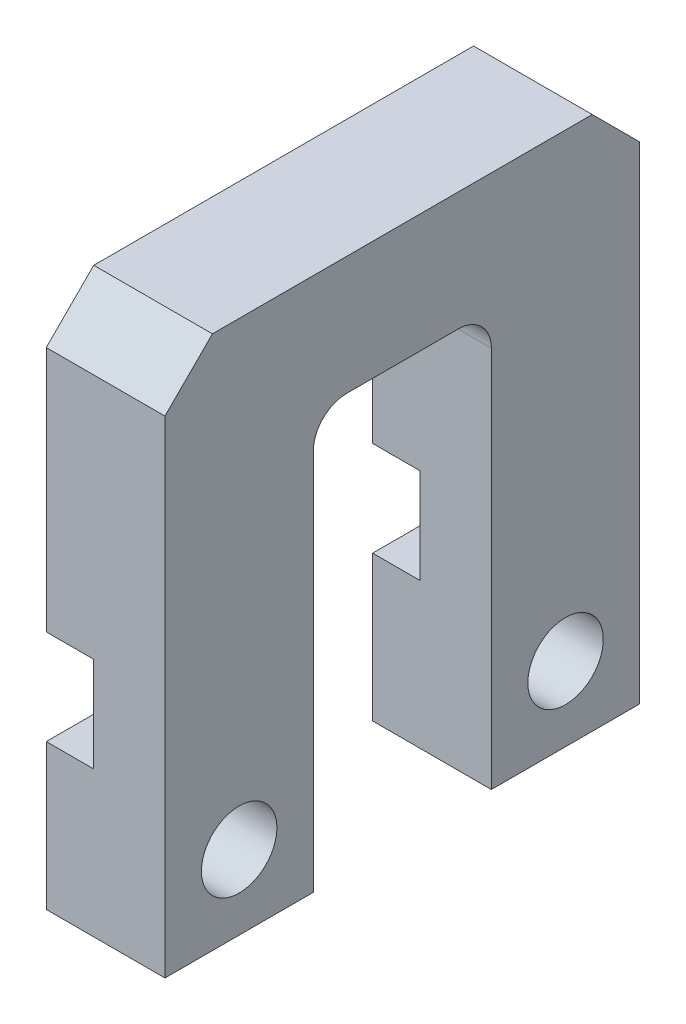
ISO-10303-21;
HEADER;
FILE_DESCRIPTION(('STEP AP214'),'2;1');
FILE_NAME('part.step','',(''),(''),'','','');
FILE_SCHEMA(('AUTOMOTIVE_DESIGN { 1 0 10303 214 1 1 1 1 }'));
ENDSEC;
DATA;
#1=APPLICATION_CONTEXT('core data for automotive mechanical design processes');
#2=APPLICATION_PROTOCOL_DEFINITION('international standard','automotive_design',2000,#1);
#3=PRODUCT_CONTEXT('',#1,'mechanical');
#4=PRODUCT('Part','Part','',(#3));
#5=PRODUCT_RELATED_PRODUCT_CATEGORY('part','',(#4));
#6=PRODUCT_DEFINITION_FORMATION('','',#4);
#7=PRODUCT_DEFINITION_CONTEXT('part definition',#1,'design');
#8=PRODUCT_DEFINITION('design','',#6,#7);
#9=PRODUCT_DEFINITION_SHAPE('','',#8);
#10=(LENGTH_UNIT() NAMED_UNIT(*) SI_UNIT(.MILLI.,.METRE.));
#11=(NAMED_UNIT(*) PLANE_ANGLE_UNIT() SI_UNIT($,.RADIAN.));
#12=(NAMED_UNIT(*) SI_UNIT($,.STERADIAN.) SOLID_ANGLE_UNIT());
#13=UNCERTAINTY_MEASURE_WITH_UNIT(LENGTH_MEASURE(1.E-05),#10,'distance_accuracy_value','');
#14=(GEOMETRIC_REPRESENTATION_CONTEXT(3) GLOBAL_UNCERTAINTY_ASSIGNED_CONTEXT((#13)) GLOBAL_UNIT_ASSIGNED_CONTEXT((#10,
#11,#12)) REPRESENTATION_CONTEXT('',''));
#15=CARTESIAN_POINT('',(0.,0.,0.));
#16=DIRECTION('',(0.,0.,1.));
#17=DIRECTION('',(1.,0.,0.));
#18=AXIS2_PLACEMENT_3D('',#15,#16,#17);
#19=CARTESIAN_POINT('',(0.,20.447,-15.6845));
#20=DIRECTION('',(-1.,0.,0.));
#21=DIRECTION('',(0.,0.,1.));
#22=AXIS2_PLACEMENT_3D('',#19,#20,#21);
#23=PLANE('',#22);
#24=DIRECTION('',(0.,0.,1.));
#25=VECTOR('',#24,1.);
#26=CARTESIAN_POINT('',(0.,28.575,0.));
#27=LINE('',#26,#25);
#28=CARTESIAN_POINT('',(0.,28.575,-22.86));
#29=VERTEX_POINT('',#28);
#30=CARTESIAN_POINT('',(0.,28.575,-2.54000000000001));
#31=VERTEX_POINT('',#30);
#32=EDGE_CURVE('E309',#29,#31,#27,.T.);
#33=ORIENTED_EDGE('',*,*,#32,.F.);
#34=DIRECTION('',(0.,0.707106781186549,0.707106781186546));
#35=VECTOR('',#34,1.);
#36=CARTESIAN_POINT('',(0.,28.09875,-23.33625));
#37=LINE('',#36,#35);
#38=CARTESIAN_POINT('',(0.,26.035,-25.4));
#39=VERTEX_POINT('',#38);
#40=EDGE_CURVE('E412',#29,#39,#37,.F.);
#41=ORIENTED_EDGE('',*,*,#40,.T.);
#42=DIRECTION('',(0.,1.,0.));
#43=VECTOR('',#42,1.);
#44=CARTESIAN_POINT('',(0.,0.,-25.4));
#45=LINE('',#44,#43);
#46=CARTESIAN_POINT('',(0.,12.85875,-25.4));
#47=VERTEX_POINT('',#46);
#48=EDGE_CURVE('E363',#47,#39,#45,.T.);
#49=ORIENTED_EDGE('',*,*,#48,.F.);
#50=DIRECTION('',(0.,0.,-1.));
#51=VECTOR('',#50,1.);
#52=CARTESIAN_POINT('',(0.,12.85875,-15.6845));
#53=LINE('',#52,#51);
#54=CARTESIAN_POINT('',(0.,12.85875,-17.4625));
#55=VERTEX_POINT('',#54);
#56=EDGE_CURVE('E399',#55,#47,#53,.T.);
#57=ORIENTED_EDGE('',*,*,#56,.F.);
#58=DIRECTION('',(0.,-1.,0.));
#59=VECTOR('',#58,1.);
#60=CARTESIAN_POINT('',(0.,20.447,-17.4625));
#61=LINE('',#60,#59);
#62=CARTESIAN_POINT('',(0.,20.447,-17.4625));
#63=VERTEX_POINT('',#62);
#64=EDGE_CURVE('E357',#63,#55,#61,.T.);
#65=ORIENTED_EDGE('',*,*,#64,.F.);
#66=CARTESIAN_POINT('',(0.,20.447,-15.6845));
#67=DIRECTION('',(-1.,0.,0.));
#68=DIRECTION('',(0.,0.,1.));
#69=AXIS2_PLACEMENT_3D('',#66,#67,#68);
#70=CIRCLE('',#69,1.778);
#71=CARTESIAN_POINT('',(0.,22.225,-15.6845));
#72=VERTEX_POINT('',#71);
#73=EDGE_CURVE('E353',#72,#63,#70,.T.);
#74=ORIENTED_EDGE('',*,*,#73,.F.);
#75=DIRECTION('',(0.,0.,-1.));
#76=VECTOR('',#75,1.);
#77=CARTESIAN_POINT('',(0.,22.225,-9.7155));
#78=LINE('',#77,#76);
#79=CARTESIAN_POINT('',(0.,22.225,-9.7155));
#80=VERTEX_POINT('',#79);
#81=EDGE_CURVE('E350',#80,#72,#78,.T.);
#82=ORIENTED_EDGE('',*,*,#81,.F.);
#83=CARTESIAN_POINT('',(0.,20.447,-9.7155));
#84=DIRECTION('',(-1.,0.,0.));
#85=DIRECTION('',(0.,0.,1.));
#86=AXIS2_PLACEMENT_3D('',#83,#84,#85);
#87=CIRCLE('',#86,1.778);
#88=CARTESIAN_POINT('',(0.,20.447,-7.9375));
#89=VERTEX_POINT('',#88);
#90=EDGE_CURVE('E347',#89,#80,#87,.T.);
#91=ORIENTED_EDGE('',*,*,#90,.F.);
#92=DIRECTION('',(0.,1.,0.));
#93=VECTOR('',#92,1.);
#94=CARTESIAN_POINT('',(0.,0.,-7.9375));
#95=LINE('',#94,#93);
#96=CARTESIAN_POINT('',(0.,12.85875,-7.9375));
#97=VERTEX_POINT('',#96);
#98=EDGE_CURVE('E342',#97,#89,#95,.T.);
#99=ORIENTED_EDGE('',*,*,#98,.F.);
#100=DIRECTION('',(0.,0.,-1.));
#101=VECTOR('',#100,1.);
#102=CARTESIAN_POINT('',(0.,12.85875,-25.4));
#103=LINE('',#102,#101);
#104=CARTESIAN_POINT('',(0.,12.85875,0.));
#105=VERTEX_POINT('',#104);
#106=EDGE_CURVE('E249',#105,#97,#103,.T.);
#107=ORIENTED_EDGE('',*,*,#106,.F.);
#108=DIRECTION('',(0.,-1.,0.));
#109=VECTOR('',#108,1.);
#110=CARTESIAN_POINT('',(0.,0.,0.));
#111=LINE('',#110,#109);
#112=CARTESIAN_POINT('',(0.,26.035,0.));
#113=VERTEX_POINT('',#112);
#114=EDGE_CURVE('E336',#113,#105,#111,.T.);
#115=ORIENTED_EDGE('',*,*,#114,.F.);
#116=DIRECTION('',(0.,-0.707106781186546,0.707106781186549));
#117=VECTOR('',#116,1.);
#118=CARTESIAN_POINT('',(0.,31.08325,-5.04825000000003));
#119=LINE('',#118,#117);
#120=EDGE_CURVE('E409',#113,#31,#119,.F.);
#121=ORIENTED_EDGE('',*,*,#120,.T.);
#122=EDGE_LOOP('',(#33,#41,#49,#57,#65,#74,#82,#91,#99,#107,#115,#121));
#123=FACE_BOUND('',#122,.T.);
#124=ADVANCED_FACE('F57',(#123),#23,.T.);
#125=DIRECTION('',(0.,0.,1.));
#126=VECTOR('',#125,1.);
#127=CARTESIAN_POINT('',(0.,7.77875,-25.4));
#128=LINE('',#127,#126);
#129=CARTESIAN_POINT('',(0.,7.77875,-25.4));
#130=VERTEX_POINT('',#129);
#131=CARTESIAN_POINT('',(0.,7.77875,-17.4625));
#132=VERTEX_POINT('',#131);
#133=EDGE_CURVE('E439',#130,#132,#128,.T.);
#134=ORIENTED_EDGE('',*,*,#133,.F.);
#135=CARTESIAN_POINT('',(0.,0.,-25.4));
#136=VERTEX_POINT('',#135);
#137=EDGE_CURVE('E255',#136,#130,#45,.T.);
#138=ORIENTED_EDGE('',*,*,#137,.F.);
#139=DIRECTION('',(0.,0.,-1.));
#140=VECTOR('',#139,1.);
#141=CARTESIAN_POINT('',(0.,0.,-17.4625));
#142=LINE('',#141,#140);
#143=CARTESIAN_POINT('',(0.,0.,-17.4625));
#144=VERTEX_POINT('',#143);
#145=EDGE_CURVE('E361',#144,#136,#142,.T.);
#146=ORIENTED_EDGE('',*,*,#145,.F.);
#147=EDGE_CURVE('E356',#132,#144,#61,.T.);
#148=ORIENTED_EDGE('',*,*,#147,.F.);
#149=EDGE_LOOP('',(#134,#138,#146,#148));
#150=FACE_BOUND('',#149,.T.);
#151=CARTESIAN_POINT('',(0.,3.96875,-21.43125));
#152=DIRECTION('',(-1.,0.,0.));
#153=DIRECTION('',(0.,0.,1.));
#154=AXIS2_PLACEMENT_3D('',#151,#152,#153);
#155=CIRCLE('',#154,2.0193);
#156=CARTESIAN_POINT('',(0.,3.96875,-19.41195));
#157=VERTEX_POINT('',#156);
#158=EDGE_CURVE('E290',#157,#157,#155,.T.);
#159=ORIENTED_EDGE('',*,*,#158,.F.);
#160=EDGE_LOOP('',(#159));
#161=FACE_BOUND('',#160,.T.);
#162=ADVANCED_FACE('F486',(#150,#161),#23,.T.);
#163=CARTESIAN_POINT('',(6.35,0.,0.));
#164=DIRECTION('',(0.,0.,-1.));
#165=DIRECTION('',(-1.,0.,0.));
#166=AXIS2_PLACEMENT_3D('',#163,#164,#165);
#167=PLANE('',#166);
#168=DIRECTION('',(0.,-1.,0.));
#169=VECTOR('',#168,1.);
#170=CARTESIAN_POINT('',(6.35,0.,0.));
#171=LINE('',#170,#169);
#172=CARTESIAN_POINT('',(6.35,26.035,0.));
#173=VERTEX_POINT('',#172);
#174=CARTESIAN_POINT('',(6.35,0.,0.));
#175=VERTEX_POINT('',#174);
#176=EDGE_CURVE('E305',#173,#175,#171,.T.);
#177=ORIENTED_EDGE('',*,*,#176,.F.);
#178=DIRECTION('',(-1.,0.,0.));
#179=VECTOR('',#178,1.);
#180=CARTESIAN_POINT('',(6.35,26.035,0.));
#181=LINE('',#180,#179);
#182=EDGE_CURVE('E11',#173,#113,#181,.T.);
#183=ORIENTED_EDGE('',*,*,#182,.T.);
#184=ORIENTED_EDGE('',*,*,#114,.T.);
#185=DIRECTION('',(-1.,0.,0.));
#186=VECTOR('',#185,1.);
#187=CARTESIAN_POINT('',(2.54,12.85875,0.));
#188=LINE('',#187,#186);
#189=CARTESIAN_POINT('',(2.54,12.85875,0.));
#190=VERTEX_POINT('',#189);
#191=EDGE_CURVE('E261',#190,#105,#188,.T.);
#192=ORIENTED_EDGE('',*,*,#191,.F.);
#193=DIRECTION('',(0.,1.,0.));
#194=VECTOR('',#193,1.);
#195=CARTESIAN_POINT('',(2.54,7.77875,0.));
#196=LINE('',#195,#194);
#197=CARTESIAN_POINT('',(2.54,7.77875,0.));
#198=VERTEX_POINT('',#197);
#199=EDGE_CURVE('E239',#198,#190,#196,.T.);
#200=ORIENTED_EDGE('',*,*,#199,.F.);
#201=DIRECTION('',(-1.,0.,0.));
#202=VECTOR('',#201,1.);
#203=CARTESIAN_POINT('',(2.54,7.77875,0.));
#204=LINE('',#203,#202);
#205=CARTESIAN_POINT('',(0.,7.77875,0.));
#206=VERTEX_POINT('',#205);
#207=EDGE_CURVE('E256',#198,#206,#204,.T.);
#208=ORIENTED_EDGE('',*,*,#207,.T.);
#209=CARTESIAN_POINT('',(0.,0.,0.));
#210=VERTEX_POINT('',#209);
#211=EDGE_CURVE('E304',#206,#210,#111,.T.);
#212=ORIENTED_EDGE('',*,*,#211,.T.);
#213=DIRECTION('',(-1.,0.,0.));
#214=VECTOR('',#213,1.);
#215=CARTESIAN_POINT('',(6.35,0.,0.));
#216=LINE('',#215,#214);
#217=EDGE_CURVE('E392',#175,#210,#216,.T.);
#218=ORIENTED_EDGE('',*,*,#217,.F.);
#219=EDGE_LOOP('',(#177,#183,#184,#192,#200,#208,#212,#218));
#220=FACE_BOUND('',#219,.T.);
#221=ADVANCED_FACE('F454',(#220),#167,.F.);
#222=CARTESIAN_POINT('',(6.35,0.,0.));
#223=DIRECTION('',(0.,1.,0.));
#224=DIRECTION('',(0.,0.,1.));
#225=AXIS2_PLACEMENT_3D('',#222,#223,#224);
#226=PLANE('',#225);
#227=DIRECTION('',(0.,0.,-1.));
#228=VECTOR('',#227,1.);
#229=CARTESIAN_POINT('',(0.,0.,0.));
#230=LINE('',#229,#228);
#231=CARTESIAN_POINT('',(0.,0.,-7.9375));
#232=VERTEX_POINT('',#231);
#233=EDGE_CURVE('E339',#210,#232,#230,.T.);
#234=ORIENTED_EDGE('',*,*,#233,.T.);
#235=DIRECTION('',(-1.,0.,0.));
#236=VECTOR('',#235,1.);
#237=CARTESIAN_POINT('',(6.35,0.,-7.9375));
#238=LINE('',#237,#236);
#239=CARTESIAN_POINT('',(6.35,0.,-7.9375));
#240=VERTEX_POINT('',#239);
#241=EDGE_CURVE('E388',#240,#232,#238,.T.);
#242=ORIENTED_EDGE('',*,*,#241,.F.);
#243=DIRECTION('',(0.,0.,-1.));
#244=VECTOR('',#243,1.);
#245=CARTESIAN_POINT('',(6.35,0.,0.));
#246=LINE('',#245,#244);
#247=EDGE_CURVE('E308',#175,#240,#246,.T.);
#248=ORIENTED_EDGE('',*,*,#247,.F.);
#249=ORIENTED_EDGE('',*,*,#217,.T.);
#250=EDGE_LOOP('',(#234,#242,#248,#249));
#251=FACE_BOUND('',#250,.T.);
#252=ADVANCED_FACE('F478',(#251),#226,.F.);
#253=CARTESIAN_POINT('',(6.35,0.,-7.9375));
#254=DIRECTION('',(0.,0.,1.));
#255=DIRECTION('',(1.,0.,0.));
#256=AXIS2_PLACEMENT_3D('',#253,#254,#255);
#257=PLANE('',#256);
#258=DIRECTION('',(0.,1.,0.));
#259=VECTOR('',#258,1.);
#260=CARTESIAN_POINT('',(2.54,0.,-7.9375));
#261=LINE('',#260,#259);
#262=CARTESIAN_POINT('',(2.54,7.77875,-7.9375));
#263=VERTEX_POINT('',#262);
#264=CARTESIAN_POINT('',(2.54,12.85875,-7.9375));
#265=VERTEX_POINT('',#264);
#266=EDGE_CURVE('E286',#263,#265,#261,.T.);
#267=ORIENTED_EDGE('',*,*,#266,.T.);
#268=DIRECTION('',(-1.,0.,0.));
#269=VECTOR('',#268,1.);
#270=CARTESIAN_POINT('',(6.35,12.85875,-7.9375));
#271=LINE('',#270,#269);
#272=EDGE_CURVE('E279',#265,#97,#271,.T.);
#273=ORIENTED_EDGE('',*,*,#272,.T.);
#274=ORIENTED_EDGE('',*,*,#98,.T.);
#275=DIRECTION('',(-1.,0.,0.));
#276=VECTOR('',#275,1.);
#277=CARTESIAN_POINT('',(6.35,20.447,-7.9375));
#278=LINE('',#277,#276);
#279=CARTESIAN_POINT('',(6.35,20.447,-7.9375));
#280=VERTEX_POINT('',#279);
#281=EDGE_CURVE('E384',#280,#89,#278,.T.);
#282=ORIENTED_EDGE('',*,*,#281,.F.);
#283=DIRECTION('',(0.,1.,0.));
#284=VECTOR('',#283,1.);
#285=CARTESIAN_POINT('',(6.35,0.,-7.9375));
#286=LINE('',#285,#284);
#287=EDGE_CURVE('E312',#240,#280,#286,.T.);
#288=ORIENTED_EDGE('',*,*,#287,.F.);
#289=ORIENTED_EDGE('',*,*,#241,.T.);
#290=CARTESIAN_POINT('',(0.,7.77875,-7.9375));
#291=VERTEX_POINT('',#290);
#292=EDGE_CURVE('E343',#232,#291,#95,.T.);
#293=ORIENTED_EDGE('',*,*,#292,.T.);
#294=DIRECTION('',(1.,0.,0.));
#295=VECTOR('',#294,1.);
#296=CARTESIAN_POINT('',(6.35,7.77875,-7.9375));
#297=LINE('',#296,#295);
#298=EDGE_CURVE('E270',#291,#263,#297,.T.);
#299=ORIENTED_EDGE('',*,*,#298,.T.);
#300=EDGE_LOOP('',(#267,#273,#274,#282,#288,#289,#293,#299));
#301=FACE_BOUND('',#300,.T.);
#302=ADVANCED_FACE('F460',(#301),#257,.F.);
#303=CARTESIAN_POINT('',(6.35,20.447,-9.7155));
#304=DIRECTION('',(-1.,0.,0.));
#305=DIRECTION('',(0.,0.,1.));
#306=AXIS2_PLACEMENT_3D('',#303,#304,#305);
#307=CYLINDRICAL_SURFACE('',#306,1.778);
#308=ORIENTED_EDGE('',*,*,#90,.T.);
#309=DIRECTION('',(-1.,0.,0.));
#310=VECTOR('',#309,1.);
#311=CARTESIAN_POINT('',(6.35,22.225,-9.7155));
#312=LINE('',#311,#310);
#313=CARTESIAN_POINT('',(6.35,22.225,-9.7155));
#314=VERTEX_POINT('',#313);
#315=EDGE_CURVE('E380',#314,#80,#312,.T.);
#316=ORIENTED_EDGE('',*,*,#315,.F.);
#317=CARTESIAN_POINT('',(6.35,20.447,-9.7155));
#318=DIRECTION('',(-1.,0.,0.));
#319=DIRECTION('',(0.,0.,1.));
#320=AXIS2_PLACEMENT_3D('',#317,#318,#319);
#321=CIRCLE('',#320,1.778);
#322=EDGE_CURVE('E315',#280,#314,#321,.T.);
#323=ORIENTED_EDGE('',*,*,#322,.F.);
#324=ORIENTED_EDGE('',*,*,#281,.T.);
#325=EDGE_LOOP('',(#308,#316,#323,#324));
#326=FACE_BOUND('',#325,.T.);
#327=ADVANCED_FACE('F548',(#326),#307,.F.);
#328=CARTESIAN_POINT('',(6.35,22.225,-9.7155));
#329=DIRECTION('',(0.,1.,0.));
#330=DIRECTION('',(0.,0.,1.));
#331=AXIS2_PLACEMENT_3D('',#328,#329,#330);
#332=PLANE('',#331);
#333=ORIENTED_EDGE('',*,*,#81,.T.);
#334=DIRECTION('',(-1.,0.,0.));
#335=VECTOR('',#334,1.);
#336=CARTESIAN_POINT('',(6.35,22.225,-15.6845));
#337=LINE('',#336,#335);
#338=CARTESIAN_POINT('',(6.35,22.225,-15.6845));
#339=VERTEX_POINT('',#338);
#340=EDGE_CURVE('E376',#339,#72,#337,.T.);
#341=ORIENTED_EDGE('',*,*,#340,.F.);
#342=DIRECTION('',(0.,0.,-1.));
#343=VECTOR('',#342,1.);
#344=CARTESIAN_POINT('',(6.35,22.225,-9.7155));
#345=LINE('',#344,#343);
#346=EDGE_CURVE('E318',#314,#339,#345,.T.);
#347=ORIENTED_EDGE('',*,*,#346,.F.);
#348=ORIENTED_EDGE('',*,*,#315,.T.);
#349=EDGE_LOOP('',(#333,#341,#347,#348));
#350=FACE_BOUND('',#349,.T.);
#351=ADVANCED_FACE('F543',(#350),#332,.F.);
#352=CARTESIAN_POINT('',(6.35,20.447,-15.6845));
#353=DIRECTION('',(-1.,0.,0.));
#354=DIRECTION('',(0.,0.,1.));
#355=AXIS2_PLACEMENT_3D('',#352,#353,#354);
#356=CYLINDRICAL_SURFACE('',#355,1.778);
#357=ORIENTED_EDGE('',*,*,#73,.T.);
#358=DIRECTION('',(-1.,0.,0.));
#359=VECTOR('',#358,1.);
#360=CARTESIAN_POINT('',(6.35,20.447,-17.4625));
#361=LINE('',#360,#359);
#362=CARTESIAN_POINT('',(6.35,20.447,-17.4625));
#363=VERTEX_POINT('',#362);
#364=EDGE_CURVE('E372',#363,#63,#361,.T.);
#365=ORIENTED_EDGE('',*,*,#364,.F.);
#366=CARTESIAN_POINT('',(6.35,20.447,-15.6845));
#367=DIRECTION('',(-1.,0.,0.));
#368=DIRECTION('',(0.,0.,1.));
#369=AXIS2_PLACEMENT_3D('',#366,#367,#368);
#370=CIRCLE('',#369,1.778);
#371=EDGE_CURVE('E321',#339,#363,#370,.T.);
#372=ORIENTED_EDGE('',*,*,#371,.F.);
#373=ORIENTED_EDGE('',*,*,#340,.T.);
#374=EDGE_LOOP('',(#357,#365,#372,#373));
#375=FACE_BOUND('',#374,.T.);
#376=ADVANCED_FACE('F539',(#375),#356,.F.);
#377=CARTESIAN_POINT('',(6.35,20.447,-17.4625));
#378=DIRECTION('',(0.,0.,-1.));
#379=DIRECTION('',(-1.,0.,0.));
#380=AXIS2_PLACEMENT_3D('',#377,#378,#379);
#381=PLANE('',#380);
#382=ORIENTED_EDGE('',*,*,#64,.T.);
#383=DIRECTION('',(1.,0.,0.));
#384=VECTOR('',#383,1.);
#385=CARTESIAN_POINT('',(6.35,12.85875,-17.4625));
#386=LINE('',#385,#384);
#387=CARTESIAN_POINT('',(2.54,12.85875,-17.4625));
#388=VERTEX_POINT('',#387);
#389=EDGE_CURVE('E275',#55,#388,#386,.T.);
#390=ORIENTED_EDGE('',*,*,#389,.T.);
#391=DIRECTION('',(0.,-1.,0.));
#392=VECTOR('',#391,1.);
#393=CARTESIAN_POINT('',(2.54,20.447,-17.4625));
#394=LINE('',#393,#392);
#395=CARTESIAN_POINT('',(2.54,7.77875,-17.4625));
#396=VERTEX_POINT('',#395);
#397=EDGE_CURVE('E283',#388,#396,#394,.T.);
#398=ORIENTED_EDGE('',*,*,#397,.T.);
#399=DIRECTION('',(-1.,0.,0.));
#400=VECTOR('',#399,1.);
#401=CARTESIAN_POINT('',(6.35,7.77875,-17.4625));
#402=LINE('',#401,#400);
#403=EDGE_CURVE('E235',#396,#132,#402,.T.);
#404=ORIENTED_EDGE('',*,*,#403,.T.);
#405=ORIENTED_EDGE('',*,*,#147,.T.);
#406=DIRECTION('',(-1.,0.,0.));
#407=VECTOR('',#406,1.);
#408=CARTESIAN_POINT('',(6.35,0.,-17.4625));
#409=LINE('',#408,#407);
#410=CARTESIAN_POINT('',(6.35,0.,-17.4625));
#411=VERTEX_POINT('',#410);
#412=EDGE_CURVE('E369',#411,#144,#409,.T.);
#413=ORIENTED_EDGE('',*,*,#412,.F.);
#414=DIRECTION('',(0.,-1.,0.));
#415=VECTOR('',#414,1.);
#416=CARTESIAN_POINT('',(6.35,20.447,-17.4625));
#417=LINE('',#416,#415);
#418=EDGE_CURVE('E324',#363,#411,#417,.T.);
#419=ORIENTED_EDGE('',*,*,#418,.F.);
#420=ORIENTED_EDGE('',*,*,#364,.T.);
#421=EDGE_LOOP('',(#382,#390,#398,#404,#405,#413,#419,#420));
#422=FACE_BOUND('',#421,.T.);
#423=ADVANCED_FACE('F533',(#422),#381,.F.);
#424=CARTESIAN_POINT('',(6.35,0.,-17.4625));
#425=DIRECTION('',(0.,1.,0.));
#426=DIRECTION('',(0.,0.,1.));
#427=AXIS2_PLACEMENT_3D('',#424,#425,#426);
#428=PLANE('',#427);
#429=ORIENTED_EDGE('',*,*,#145,.T.);
#430=DIRECTION('',(-1.,0.,0.));
#431=VECTOR('',#430,1.);
#432=CARTESIAN_POINT('',(6.35,0.,-25.4));
#433=LINE('',#432,#431);
#434=CARTESIAN_POINT('',(6.35,0.,-25.4));
#435=VERTEX_POINT('',#434);
#436=EDGE_CURVE('E335',#435,#136,#433,.T.);
#437=ORIENTED_EDGE('',*,*,#436,.F.);
#438=DIRECTION('',(0.,0.,-1.));
#439=VECTOR('',#438,1.);
#440=CARTESIAN_POINT('',(6.35,0.,-17.4625));
#441=LINE('',#440,#439);
#442=EDGE_CURVE('E327',#411,#435,#441,.T.);
#443=ORIENTED_EDGE('',*,*,#442,.F.);
#444=ORIENTED_EDGE('',*,*,#412,.T.);
#445=EDGE_LOOP('',(#429,#437,#443,#444));
#446=FACE_BOUND('',#445,.T.);
#447=ADVANCED_FACE('F554',(#446),#428,.F.);
#448=CARTESIAN_POINT('',(6.35,0.,-25.4));
#449=DIRECTION('',(0.,0.,1.));
#450=DIRECTION('',(1.,0.,0.));
#451=AXIS2_PLACEMENT_3D('',#448,#449,#450);
#452=PLANE('',#451);
#453=ORIENTED_EDGE('',*,*,#48,.T.);
#454=DIRECTION('',(1.,0.,0.));
#455=VECTOR('',#454,1.);
#456=CARTESIAN_POINT('',(6.35,26.035,-25.4));
#457=LINE('',#456,#455);
#458=CARTESIAN_POINT('',(6.35,26.035,-25.4));
#459=VERTEX_POINT('',#458);
#460=EDGE_CURVE('E88',#39,#459,#457,.T.);
#461=ORIENTED_EDGE('',*,*,#460,.T.);
#462=DIRECTION('',(0.,1.,0.));
#463=VECTOR('',#462,1.);
#464=CARTESIAN_POINT('',(6.35,0.,-25.4));
#465=LINE('',#464,#463);
#466=EDGE_CURVE('E329',#435,#459,#465,.T.);
#467=ORIENTED_EDGE('',*,*,#466,.F.);
#468=ORIENTED_EDGE('',*,*,#436,.T.);
#469=ORIENTED_EDGE('',*,*,#137,.T.);
#470=DIRECTION('',(-1.,0.,0.));
#471=VECTOR('',#470,1.);
#472=CARTESIAN_POINT('',(2.54,7.77875,-25.4));
#473=LINE('',#472,#471);
#474=CARTESIAN_POINT('',(2.54,7.77875,-25.4));
#475=VERTEX_POINT('',#474);
#476=EDGE_CURVE('E232',#475,#130,#473,.T.);
#477=ORIENTED_EDGE('',*,*,#476,.F.);
#478=DIRECTION('',(0.,-1.,0.));
#479=VECTOR('',#478,1.);
#480=CARTESIAN_POINT('',(2.54,7.77875,-25.4));
#481=LINE('',#480,#479);
#482=CARTESIAN_POINT('',(2.54,12.85875,-25.4));
#483=VERTEX_POINT('',#482);
#484=EDGE_CURVE('E243',#483,#475,#481,.T.);
#485=ORIENTED_EDGE('',*,*,#484,.F.);
#486=DIRECTION('',(-1.,0.,0.));
#487=VECTOR('',#486,1.);
#488=CARTESIAN_POINT('',(2.54,12.85875,-25.4));
#489=LINE('',#488,#487);
#490=EDGE_CURVE('E271',#483,#47,#489,.T.);
#491=ORIENTED_EDGE('',*,*,#490,.T.);
#492=EDGE_LOOP('',(#453,#461,#467,#468,#469,#477,#485,#491));
#493=FACE_BOUND('',#492,.T.);
#494=ADVANCED_FACE('F252',(#493),#452,.F.);
#495=CARTESIAN_POINT('',(6.35,28.575,0.));
#496=DIRECTION('',(0.,-1.,0.));
#497=DIRECTION('',(0.,0.,-1.));
#498=AXIS2_PLACEMENT_3D('',#495,#496,#497);
#499=PLANE('',#498);
#500=DIRECTION('',(0.,0.,1.));
#501=VECTOR('',#500,1.);
#502=CARTESIAN_POINT('',(6.35,28.575,0.));
#503=LINE('',#502,#501);
#504=CARTESIAN_POINT('',(6.35,28.575,-22.86));
#505=VERTEX_POINT('',#504);
#506=CARTESIAN_POINT('',(6.35,28.575,-2.54000000000001));
#507=VERTEX_POINT('',#506);
#508=EDGE_CURVE('E332',#505,#507,#503,.T.);
#509=ORIENTED_EDGE('',*,*,#508,.F.);
#510=DIRECTION('',(-1.,0.,0.));
#511=VECTOR('',#510,1.);
#512=CARTESIAN_POINT('',(6.35,28.575,-22.86));
#513=LINE('',#512,#511);
#514=EDGE_CURVE('E405',#505,#29,#513,.T.);
#515=ORIENTED_EDGE('',*,*,#514,.T.);
#516=ORIENTED_EDGE('',*,*,#32,.T.);
#517=DIRECTION('',(1.,0.,0.));
#518=VECTOR('',#517,1.);
#519=CARTESIAN_POINT('',(6.35,28.575,-2.54000000000001));
#520=LINE('',#519,#518);
#521=EDGE_CURVE('E402',#31,#507,#520,.T.);
#522=ORIENTED_EDGE('',*,*,#521,.T.);
#523=EDGE_LOOP('',(#509,#515,#516,#522));
#524=FACE_BOUND('',#523,.T.);
#525=ADVANCED_FACE('F425',(#524),#499,.F.);
#526=CARTESIAN_POINT('',(6.35,20.447,-15.6845));
#527=DIRECTION('',(-1.,0.,0.));
#528=DIRECTION('',(0.,0.,1.));
#529=AXIS2_PLACEMENT_3D('',#526,#527,#528);
#530=PLANE('',#529);
#531=CARTESIAN_POINT('',(6.35,3.96875,-21.43125));
#532=DIRECTION('',(-1.,0.,0.));
#533=DIRECTION('',(0.,0.,1.));
#534=AXIS2_PLACEMENT_3D('',#531,#532,#533);
#535=CIRCLE('',#534,2.0193);
#536=CARTESIAN_POINT('',(6.35,3.96875,-19.41195));
#537=VERTEX_POINT('',#536);
#538=EDGE_CURVE('E293',#537,#537,#535,.T.);
#539=ORIENTED_EDGE('',*,*,#538,.T.);
#540=EDGE_LOOP('',(#539));
#541=FACE_BOUND('',#540,.T.);
#542=CARTESIAN_POINT('',(6.35,3.96875,-3.96875));
#543=DIRECTION('',(-1.,0.,0.));
#544=DIRECTION('',(0.,0.,1.));
#545=AXIS2_PLACEMENT_3D('',#542,#543,#544);
#546=CIRCLE('',#545,2.0193);
#547=CARTESIAN_POINT('',(6.35,3.96875,-1.94945));
#548=VERTEX_POINT('',#547);
#549=EDGE_CURVE('E300',#548,#548,#546,.T.);
#550=ORIENTED_EDGE('',*,*,#549,.T.);
#551=EDGE_LOOP('',(#550));
#552=FACE_BOUND('',#551,.T.);
#553=ORIENTED_EDGE('',*,*,#466,.T.);
#554=DIRECTION('',(0.,-0.707106781186549,-0.707106781186546));
#555=VECTOR('',#554,1.);
#556=CARTESIAN_POINT('',(6.35,28.575,-22.86));
#557=LINE('',#556,#555);
#558=EDGE_CURVE('E67',#459,#505,#557,.F.);
#559=ORIENTED_EDGE('',*,*,#558,.T.);
#560=ORIENTED_EDGE('',*,*,#508,.T.);
#561=DIRECTION('',(0.,0.707106781186546,-0.707106781186549));
#562=VECTOR('',#561,1.);
#563=CARTESIAN_POINT('',(6.35,26.035,0.));
#564=LINE('',#563,#562);
#565=EDGE_CURVE('E77',#507,#173,#564,.F.);
#566=ORIENTED_EDGE('',*,*,#565,.T.);
#567=ORIENTED_EDGE('',*,*,#176,.T.);
#568=ORIENTED_EDGE('',*,*,#247,.T.);
#569=ORIENTED_EDGE('',*,*,#287,.T.);
#570=ORIENTED_EDGE('',*,*,#322,.T.);
#571=ORIENTED_EDGE('',*,*,#346,.T.);
#572=ORIENTED_EDGE('',*,*,#371,.T.);
#573=ORIENTED_EDGE('',*,*,#418,.T.);
#574=ORIENTED_EDGE('',*,*,#442,.T.);
#575=EDGE_LOOP('',(#553,#559,#560,#566,#567,#568,#569,#570,#571,#572,#573,#574));
#576=FACE_BOUND('',#575,.T.);
#577=ADVANCED_FACE('F421',(#541,#552,#576),#530,.F.);
#578=DIRECTION('',(0.,0.,1.));
#579=VECTOR('',#578,1.);
#580=CARTESIAN_POINT('',(0.,7.77875,-15.6845));
#581=LINE('',#580,#579);
#582=EDGE_CURVE('E396',#291,#206,#581,.T.);
#583=ORIENTED_EDGE('',*,*,#582,.F.);
#584=ORIENTED_EDGE('',*,*,#292,.F.);
#585=ORIENTED_EDGE('',*,*,#233,.F.);
#586=ORIENTED_EDGE('',*,*,#211,.F.);
#587=EDGE_LOOP('',(#583,#584,#585,#586));
#588=FACE_BOUND('',#587,.T.);
#589=CARTESIAN_POINT('',(0.,3.96875,-3.96875));
#590=DIRECTION('',(-1.,0.,0.));
#591=DIRECTION('',(0.,0.,1.));
#592=AXIS2_PLACEMENT_3D('',#589,#590,#591);
#593=CIRCLE('',#592,2.0193);
#594=CARTESIAN_POINT('',(0.,3.96875,-1.94945));
#595=VERTEX_POINT('',#594);
#596=EDGE_CURVE('E296',#595,#595,#593,.T.);
#597=ORIENTED_EDGE('',*,*,#596,.F.);
#598=EDGE_LOOP('',(#597));
#599=FACE_BOUND('',#598,.T.);
#600=ADVANCED_FACE('F473',(#588,#599),#23,.T.);
#601=CARTESIAN_POINT('',(0.,3.96875,-3.96875));
#602=DIRECTION('',(-1.,0.,0.));
#603=DIRECTION('',(0.,0.,1.));
#604=AXIS2_PLACEMENT_3D('',#601,#602,#603);
#605=CYLINDRICAL_SURFACE('',#604,2.0193);
#606=ORIENTED_EDGE('',*,*,#549,.F.);
#607=EDGE_LOOP('',(#606));
#608=FACE_BOUND('',#607,.T.);
#609=ORIENTED_EDGE('',*,*,#596,.T.);
#610=EDGE_LOOP('',(#609));
#611=FACE_BOUND('',#610,.T.);
#612=ADVANCED_FACE('F497',(#608,#611),#605,.F.);
#613=CARTESIAN_POINT('',(0.,3.96875,-21.43125));
#614=DIRECTION('',(-1.,0.,0.));
#615=DIRECTION('',(0.,0.,1.));
#616=AXIS2_PLACEMENT_3D('',#613,#614,#615);
#617=CYLINDRICAL_SURFACE('',#616,2.0193);
#618=ORIENTED_EDGE('',*,*,#538,.F.);
#619=EDGE_LOOP('',(#618));
#620=FACE_BOUND('',#619,.T.);
#621=ORIENTED_EDGE('',*,*,#158,.T.);
#622=EDGE_LOOP('',(#621));
#623=FACE_BOUND('',#622,.T.);
#624=ADVANCED_FACE('F503',(#620,#623),#617,.F.);
#625=CARTESIAN_POINT('',(2.54,12.85875,-25.4));
#626=DIRECTION('',(0.,1.,0.));
#627=DIRECTION('',(0.,0.,1.));
#628=AXIS2_PLACEMENT_3D('',#625,#626,#627);
#629=PLANE('',#628);
#630=DIRECTION('',(0.,0.,-1.));
#631=VECTOR('',#630,1.);
#632=CARTESIAN_POINT('',(2.54,12.85875,-25.4));
#633=LINE('',#632,#631);
#634=EDGE_CURVE('E257',#190,#265,#633,.T.);
#635=ORIENTED_EDGE('',*,*,#634,.F.);
#636=ORIENTED_EDGE('',*,*,#191,.T.);
#637=ORIENTED_EDGE('',*,*,#106,.T.);
#638=ORIENTED_EDGE('',*,*,#272,.F.);
#639=EDGE_LOOP('',(#635,#636,#637,#638));
#640=FACE_BOUND('',#639,.T.);
#641=ADVANCED_FACE('F452',(#640),#629,.F.);
#642=CARTESIAN_POINT('',(2.54,7.77875,-25.4));
#643=DIRECTION('',(0.,-1.,0.));
#644=DIRECTION('',(0.,0.,-1.));
#645=AXIS2_PLACEMENT_3D('',#642,#643,#644);
#646=PLANE('',#645);
#647=ORIENTED_EDGE('',*,*,#582,.T.);
#648=ORIENTED_EDGE('',*,*,#207,.F.);
#649=DIRECTION('',(0.,0.,1.));
#650=VECTOR('',#649,1.);
#651=CARTESIAN_POINT('',(2.54,7.77875,-25.4));
#652=LINE('',#651,#650);
#653=EDGE_CURVE('E240',#263,#198,#652,.T.);
#654=ORIENTED_EDGE('',*,*,#653,.F.);
#655=ORIENTED_EDGE('',*,*,#298,.F.);
#656=EDGE_LOOP('',(#647,#648,#654,#655));
#657=FACE_BOUND('',#656,.T.);
#658=ADVANCED_FACE('F463',(#657),#646,.F.);
#659=CARTESIAN_POINT('',(2.54,0.,0.));
#660=DIRECTION('',(1.,0.,0.));
#661=DIRECTION('',(0.,0.,-1.));
#662=AXIS2_PLACEMENT_3D('',#659,#660,#661);
#663=PLANE('',#662);
#664=ORIENTED_EDGE('',*,*,#653,.T.);
#665=ORIENTED_EDGE('',*,*,#199,.T.);
#666=ORIENTED_EDGE('',*,*,#634,.T.);
#667=ORIENTED_EDGE('',*,*,#266,.F.);
#668=EDGE_LOOP('',(#664,#665,#666,#667));
#669=FACE_BOUND('',#668,.T.);
#670=ADVANCED_FACE('F446',(#669),#663,.F.);
#671=EDGE_CURVE('E246',#388,#483,#633,.T.);
#672=ORIENTED_EDGE('',*,*,#671,.T.);
#673=ORIENTED_EDGE('',*,*,#484,.T.);
#674=EDGE_CURVE('E228',#475,#396,#652,.T.);
#675=ORIENTED_EDGE('',*,*,#674,.T.);
#676=ORIENTED_EDGE('',*,*,#397,.F.);
#677=EDGE_LOOP('',(#672,#673,#675,#676));
#678=FACE_BOUND('',#677,.T.);
#679=ADVANCED_FACE('F244',(#678),#663,.F.);
#680=ORIENTED_EDGE('',*,*,#56,.T.);
#681=ORIENTED_EDGE('',*,*,#490,.F.);
#682=ORIENTED_EDGE('',*,*,#671,.F.);
#683=ORIENTED_EDGE('',*,*,#389,.F.);
#684=EDGE_LOOP('',(#680,#681,#682,#683));
#685=FACE_BOUND('',#684,.T.);
#686=ADVANCED_FACE('F520',(#685),#629,.F.);
#687=ORIENTED_EDGE('',*,*,#674,.F.);
#688=ORIENTED_EDGE('',*,*,#476,.T.);
#689=ORIENTED_EDGE('',*,*,#133,.T.);
#690=ORIENTED_EDGE('',*,*,#403,.F.);
#691=EDGE_LOOP('',(#687,#688,#689,#690));
#692=FACE_BOUND('',#691,.T.);
#693=ADVANCED_FACE('F230',(#692),#646,.F.);
#694=CARTESIAN_POINT('',(6.35,28.575,-22.86));
#695=DIRECTION('',(0.,-0.707106781186546,0.707106781186549));
#696=DIRECTION('',(-1.,0.,0.));
#697=AXIS2_PLACEMENT_3D('',#694,#695,#696);
#698=PLANE('',#697);
#699=ORIENTED_EDGE('',*,*,#558,.F.);
#700=ORIENTED_EDGE('',*,*,#460,.F.);
#701=ORIENTED_EDGE('',*,*,#40,.F.);
#702=ORIENTED_EDGE('',*,*,#514,.F.);
#703=EDGE_LOOP('',(#699,#700,#701,#702));
#704=FACE_BOUND('',#703,.T.);
#705=ADVANCED_FACE('F428',(#704),#698,.F.);
#706=CARTESIAN_POINT('',(6.35,26.035,0.));
#707=DIRECTION('',(0.,-0.707106781186549,-0.707106781186546));
#708=DIRECTION('',(-1.,0.,0.));
#709=AXIS2_PLACEMENT_3D('',#706,#707,#708);
#710=PLANE('',#709);
#711=ORIENTED_EDGE('',*,*,#565,.F.);
#712=ORIENTED_EDGE('',*,*,#521,.F.);
#713=ORIENTED_EDGE('',*,*,#120,.F.);
#714=ORIENTED_EDGE('',*,*,#182,.F.);
#715=EDGE_LOOP('',(#711,#712,#713,#714));
#716=FACE_BOUND('',#715,.T.);
#717=ADVANCED_FACE('F60',(#716),#710,.F.);
#718=CLOSED_SHELL('',(#124,#162,#221,#252,#302,#327,#351,#376,#423,#447,#494,#525,#577,#600,
#612,#624,#641,#658,#670,#679,#686,#693,#705,#717));
#719=MANIFOLD_SOLID_BREP('B2',#718);
#720=ADVANCED_BREP_SHAPE_REPRESENTATION('',(#18,#719),#14);
#721=SHAPE_DEFINITION_REPRESENTATION(#9,#720);
ENDSEC;
END-ISO-10303-21;
